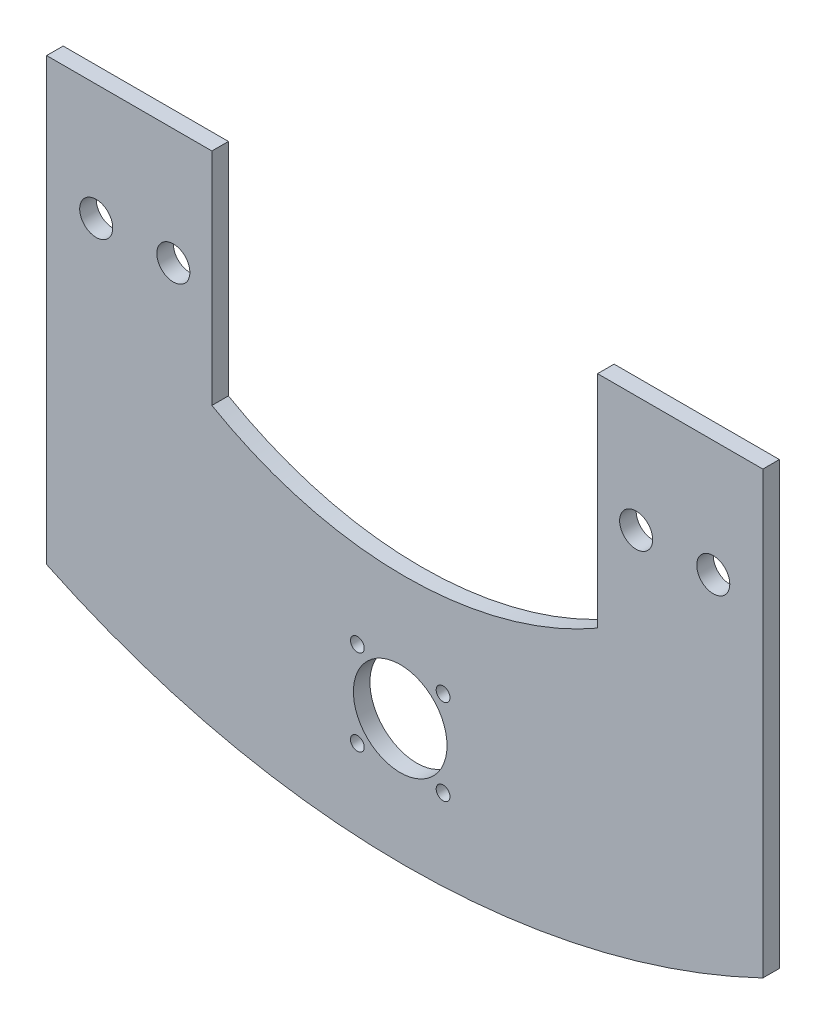
ISO-10303-21;
HEADER;
FILE_DESCRIPTION(('STEP AP214'),'2;1');
FILE_NAME('part.step','',(''),(''),'','','');
FILE_SCHEMA(('AUTOMOTIVE_DESIGN { 1 0 10303 214 1 1 1 1 }'));
ENDSEC;
DATA;
#1=APPLICATION_CONTEXT('core data for automotive mechanical design processes');
#2=APPLICATION_PROTOCOL_DEFINITION('international standard','automotive_design',2000,#1);
#3=PRODUCT_CONTEXT('',#1,'mechanical');
#4=PRODUCT('Part','Part','',(#3));
#5=PRODUCT_RELATED_PRODUCT_CATEGORY('part','',(#4));
#6=PRODUCT_DEFINITION_FORMATION('','',#4);
#7=PRODUCT_DEFINITION_CONTEXT('part definition',#1,'design');
#8=PRODUCT_DEFINITION('design','',#6,#7);
#9=PRODUCT_DEFINITION_SHAPE('','',#8);
#10=(LENGTH_UNIT() NAMED_UNIT(*) SI_UNIT(.MILLI.,.METRE.));
#11=(NAMED_UNIT(*) PLANE_ANGLE_UNIT() SI_UNIT($,.RADIAN.));
#12=(NAMED_UNIT(*) SI_UNIT($,.STERADIAN.) SOLID_ANGLE_UNIT());
#13=UNCERTAINTY_MEASURE_WITH_UNIT(LENGTH_MEASURE(1.E-05),#10,'distance_accuracy_value','');
#14=(GEOMETRIC_REPRESENTATION_CONTEXT(3) GLOBAL_UNCERTAINTY_ASSIGNED_CONTEXT((#13)) GLOBAL_UNIT_ASSIGNED_CONTEXT((#10,
#11,#12)) REPRESENTATION_CONTEXT('',''));
#15=CARTESIAN_POINT('',(0.,0.,0.));
#16=DIRECTION('',(0.,0.,1.));
#17=DIRECTION('',(1.,0.,0.));
#18=AXIS2_PLACEMENT_3D('',#15,#16,#17);
#19=CARTESIAN_POINT('',(0.820334830002166,96.841601103084,3.));
#20=DIRECTION('',(0.,0.,1.));
#21=DIRECTION('',(1.,0.,0.));
#22=AXIS2_PLACEMENT_3D('',#19,#20,#21);
#23=PLANE('',#22);
#24=CARTESIAN_POINT('',(7.78,-38.2569345928676,3.));
#25=DIRECTION('',(0.,0.,1.));
#26=DIRECTION('',(-1.,0.,0.));
#27=AXIS2_PLACEMENT_3D('',#24,#25,#26);
#28=CIRCLE('',#27,1.25);
#29=CARTESIAN_POINT('',(6.53,-38.2569345928676,3.));
#30=VERTEX_POINT('',#29);
#31=EDGE_CURVE('E293',#30,#30,#28,.T.);
#32=ORIENTED_EDGE('',*,*,#31,.F.);
#33=EDGE_LOOP('',(#32));
#34=FACE_BOUND('',#33,.T.);
#35=CARTESIAN_POINT('',(0.,-30.4769345928675,3.));
#36=DIRECTION('',(0.,0.,1.));
#37=DIRECTION('',(1.,0.,0.));
#38=AXIS2_PLACEMENT_3D('',#35,#36,#37);
#39=CIRCLE('',#38,8.5);
#40=CARTESIAN_POINT('',(8.5,-30.4769345928675,3.));
#41=VERTEX_POINT('',#40);
#42=EDGE_CURVE('E297',#41,#41,#39,.T.);
#43=ORIENTED_EDGE('',*,*,#42,.F.);
#44=EDGE_LOOP('',(#43));
#45=FACE_BOUND('',#44,.T.);
#46=CARTESIAN_POINT('',(-7.78,-38.2569345928676,3.));
#47=DIRECTION('',(0.,0.,1.));
#48=DIRECTION('',(1.,0.,0.));
#49=AXIS2_PLACEMENT_3D('',#46,#47,#48);
#50=CIRCLE('',#49,1.24999999999999);
#51=CARTESIAN_POINT('',(-6.53000000000001,-38.2569345928676,3.));
#52=VERTEX_POINT('',#51);
#53=EDGE_CURVE('E283',#52,#52,#50,.T.);
#54=ORIENTED_EDGE('',*,*,#53,.F.);
#55=EDGE_LOOP('',(#54));
#56=FACE_BOUND('',#55,.T.);
#57=CARTESIAN_POINT('',(-7.78,-22.6969345928675,3.));
#58=DIRECTION('',(0.,0.,1.));
#59=DIRECTION('',(-1.,0.,0.));
#60=AXIS2_PLACEMENT_3D('',#57,#58,#59);
#61=CIRCLE('',#60,1.24999999999999);
#62=CARTESIAN_POINT('',(-9.03,-22.6969345928675,3.));
#63=VERTEX_POINT('',#62);
#64=EDGE_CURVE('E294',#63,#63,#61,.T.);
#65=ORIENTED_EDGE('',*,*,#64,.F.);
#66=EDGE_LOOP('',(#65));
#67=FACE_BOUND('',#66,.T.);
#68=CARTESIAN_POINT('',(7.78,-22.6969345928675,3.));
#69=DIRECTION('',(0.,0.,1.));
#70=DIRECTION('',(1.,0.,0.));
#71=AXIS2_PLACEMENT_3D('',#68,#69,#70);
#72=CIRCLE('',#71,1.25);
#73=CARTESIAN_POINT('',(9.03,-22.6969345928675,3.));
#74=VERTEX_POINT('',#73);
#75=EDGE_CURVE('E164',#74,#74,#72,.T.);
#76=ORIENTED_EDGE('',*,*,#75,.F.);
#77=EDGE_LOOP('',(#76));
#78=FACE_BOUND('',#77,.T.);
#79=CARTESIAN_POINT('',(-55.1796651699977,20.5544747081712,3.));
#80=DIRECTION('',(0.,0.,1.));
#81=DIRECTION('',(-1.,0.,0.));
#82=AXIS2_PLACEMENT_3D('',#79,#80,#81);
#83=CIRCLE('',#82,3.);
#84=CARTESIAN_POINT('',(-58.1796651699977,20.5544747081712,3.));
#85=VERTEX_POINT('',#84);
#86=EDGE_CURVE('E187',#85,#85,#83,.T.);
#87=ORIENTED_EDGE('',*,*,#86,.F.);
#88=EDGE_LOOP('',(#87));
#89=FACE_BOUND('',#88,.T.);
#90=CARTESIAN_POINT('',(56.8203348300023,20.5544747081712,3.));
#91=DIRECTION('',(0.,0.,1.));
#92=DIRECTION('',(1.,0.,0.));
#93=AXIS2_PLACEMENT_3D('',#90,#91,#92);
#94=CIRCLE('',#93,3.);
#95=CARTESIAN_POINT('',(59.8203348300023,20.5544747081712,3.));
#96=VERTEX_POINT('',#95);
#97=EDGE_CURVE('E137',#96,#96,#94,.T.);
#98=ORIENTED_EDGE('',*,*,#97,.F.);
#99=EDGE_LOOP('',(#98));
#100=FACE_BOUND('',#99,.T.);
#101=DIRECTION('',(-1.,0.,0.));
#102=VECTOR('',#101,1.);
#103=CARTESIAN_POINT('',(-34.1796651699977,41.6565427571262,3.));
#104=LINE('',#103,#102);
#105=CARTESIAN_POINT('',(-34.1796651699977,41.6565427571262,3.));
#106=VERTEX_POINT('',#105);
#107=CARTESIAN_POINT('',(-64.1796651699977,41.6565427571262,3.));
#108=VERTEX_POINT('',#107);
#109=EDGE_CURVE('E148',#106,#108,#104,.T.);
#110=ORIENTED_EDGE('',*,*,#109,.T.);
#111=DIRECTION('',(0.,-1.,0.));
#112=VECTOR('',#111,1.);
#113=CARTESIAN_POINT('',(-64.1796651699977,41.6565427571262,3.));
#114=LINE('',#113,#112);
#115=CARTESIAN_POINT('',(-64.1796651699977,-38.3434572428738,3.));
#116=VERTEX_POINT('',#115);
#117=EDGE_CURVE('E96',#108,#116,#114,.T.);
#118=ORIENTED_EDGE('',*,*,#117,.T.);
#119=CARTESIAN_POINT('',(0.820334830002166,96.841601103084,3.));
#120=DIRECTION('',(0.,0.,1.));
#121=DIRECTION('',(1.,0.,0.));
#122=AXIS2_PLACEMENT_3D('',#119,#120,#121);
#123=CIRCLE('',#122,150.);
#124=CARTESIAN_POINT('',(65.8203348300023,-38.3434572428737,3.));
#125=VERTEX_POINT('',#124);
#126=EDGE_CURVE('E205',#116,#125,#123,.T.);
#127=ORIENTED_EDGE('',*,*,#126,.T.);
#128=DIRECTION('',(0.,1.,0.));
#129=VECTOR('',#128,1.);
#130=CARTESIAN_POINT('',(65.8203348300023,-38.3434572428737,3.));
#131=LINE('',#130,#129);
#132=CARTESIAN_POINT('',(65.8203348300023,41.6565427571263,3.));
#133=VERTEX_POINT('',#132);
#134=EDGE_CURVE('E207',#125,#133,#131,.T.);
#135=ORIENTED_EDGE('',*,*,#134,.T.);
#136=DIRECTION('',(-1.,0.,0.));
#137=VECTOR('',#136,1.);
#138=CARTESIAN_POINT('',(65.8203348300023,41.6565427571263,3.));
#139=LINE('',#138,#137);
#140=CARTESIAN_POINT('',(35.8203348300023,41.6565427571263,3.));
#141=VERTEX_POINT('',#140);
#142=EDGE_CURVE('E115',#133,#141,#139,.T.);
#143=ORIENTED_EDGE('',*,*,#142,.T.);
#144=DIRECTION('',(0.,-1.,0.));
#145=VECTOR('',#144,1.);
#146=CARTESIAN_POINT('',(35.8203348300023,41.6565427571263,3.));
#147=LINE('',#146,#145);
#148=CARTESIAN_POINT('',(35.8203348300023,1.6565427571263,3.));
#149=VERTEX_POINT('',#148);
#150=EDGE_CURVE('E109',#141,#149,#147,.T.);
#151=ORIENTED_EDGE('',*,*,#150,.T.);
#152=CARTESIAN_POINT('',(0.820334830002178,62.2783210220369,3.));
#153=DIRECTION('',(0.,0.,-1.));
#154=DIRECTION('',(1.,0.,0.));
#155=AXIS2_PLACEMENT_3D('',#152,#153,#154);
#156=CIRCLE('',#155,70.);
#157=CARTESIAN_POINT('',(-34.1796651699977,1.65654275712619,3.));
#158=VERTEX_POINT('',#157);
#159=EDGE_CURVE('E113',#149,#158,#156,.T.);
#160=ORIENTED_EDGE('',*,*,#159,.T.);
#161=DIRECTION('',(0.,1.,0.));
#162=VECTOR('',#161,1.);
#163=CARTESIAN_POINT('',(-34.1796651699977,1.65654275712619,3.));
#164=LINE('',#163,#162);
#165=EDGE_CURVE('E53',#158,#106,#164,.T.);
#166=ORIENTED_EDGE('',*,*,#165,.T.);
#167=EDGE_LOOP('',(#110,#118,#127,#135,#143,#151,#160,#166));
#168=FACE_BOUND('',#167,.T.);
#169=CARTESIAN_POINT('',(42.8203348300023,20.5544747081712,3.));
#170=DIRECTION('',(0.,0.,1.));
#171=DIRECTION('',(1.,0.,0.));
#172=AXIS2_PLACEMENT_3D('',#169,#170,#171);
#173=CIRCLE('',#172,2.99999999999999);
#174=CARTESIAN_POINT('',(45.8203348300023,20.5544747081712,3.));
#175=VERTEX_POINT('',#174);
#176=EDGE_CURVE('E193',#175,#175,#173,.T.);
#177=ORIENTED_EDGE('',*,*,#176,.F.);
#178=EDGE_LOOP('',(#177));
#179=FACE_BOUND('',#178,.T.);
#180=CARTESIAN_POINT('',(-41.1796651699977,20.5544747081712,3.));
#181=DIRECTION('',(0.,0.,1.));
#182=DIRECTION('',(-1.,0.,0.));
#183=AXIS2_PLACEMENT_3D('',#180,#181,#182);
#184=CIRCLE('',#183,2.99999999999999);
#185=CARTESIAN_POINT('',(-44.1796651699977,20.5544747081712,3.));
#186=VERTEX_POINT('',#185);
#187=EDGE_CURVE('E178',#186,#186,#184,.T.);
#188=ORIENTED_EDGE('',*,*,#187,.F.);
#189=EDGE_LOOP('',(#188));
#190=FACE_BOUND('',#189,.T.);
#191=ADVANCED_FACE('F34',(#34,#45,#56,#67,#78,#89,#100,#168,#179,#190),#23,.T.);
#192=CARTESIAN_POINT('',(0.820334830002166,96.841601103084,0.));
#193=DIRECTION('',(0.,0.,1.));
#194=DIRECTION('',(1.,0.,0.));
#195=AXIS2_PLACEMENT_3D('',#192,#193,#194);
#196=PLANE('',#195);
#197=CARTESIAN_POINT('',(7.78,-38.2569345928676,0.));
#198=DIRECTION('',(0.,0.,1.));
#199=DIRECTION('',(1.,0.,0.));
#200=AXIS2_PLACEMENT_3D('',#197,#198,#199);
#201=CIRCLE('',#200,1.25);
#202=CARTESIAN_POINT('',(9.03,-38.2569345928676,0.));
#203=VERTEX_POINT('',#202);
#204=EDGE_CURVE('E38',#203,#203,#201,.T.);
#205=ORIENTED_EDGE('',*,*,#204,.T.);
#206=EDGE_LOOP('',(#205));
#207=FACE_BOUND('',#206,.T.);
#208=CARTESIAN_POINT('',(0.,-30.4769345928675,0.));
#209=DIRECTION('',(0.,0.,1.));
#210=DIRECTION('',(1.,0.,0.));
#211=AXIS2_PLACEMENT_3D('',#208,#209,#210);
#212=CIRCLE('',#211,8.5);
#213=CARTESIAN_POINT('',(8.5,-30.4769345928675,0.));
#214=VERTEX_POINT('',#213);
#215=EDGE_CURVE('E169',#214,#214,#212,.T.);
#216=ORIENTED_EDGE('',*,*,#215,.T.);
#217=EDGE_LOOP('',(#216));
#218=FACE_BOUND('',#217,.T.);
#219=CARTESIAN_POINT('',(-7.78,-38.2569345928676,0.));
#220=DIRECTION('',(0.,0.,1.));
#221=DIRECTION('',(1.,0.,0.));
#222=AXIS2_PLACEMENT_3D('',#219,#220,#221);
#223=CIRCLE('',#222,1.24999999999999);
#224=CARTESIAN_POINT('',(-6.53000000000001,-38.2569345928676,0.));
#225=VERTEX_POINT('',#224);
#226=EDGE_CURVE('E167',#225,#225,#223,.T.);
#227=ORIENTED_EDGE('',*,*,#226,.T.);
#228=EDGE_LOOP('',(#227));
#229=FACE_BOUND('',#228,.T.);
#230=CARTESIAN_POINT('',(-7.78,-22.6969345928675,0.));
#231=DIRECTION('',(0.,0.,1.));
#232=DIRECTION('',(1.,0.,0.));
#233=AXIS2_PLACEMENT_3D('',#230,#231,#232);
#234=CIRCLE('',#233,1.24999999999999);
#235=CARTESIAN_POINT('',(-6.53000000000001,-22.6969345928675,0.));
#236=VERTEX_POINT('',#235);
#237=EDGE_CURVE('E163',#236,#236,#234,.T.);
#238=ORIENTED_EDGE('',*,*,#237,.T.);
#239=EDGE_LOOP('',(#238));
#240=FACE_BOUND('',#239,.T.);
#241=CARTESIAN_POINT('',(7.78,-22.6969345928675,0.));
#242=DIRECTION('',(0.,0.,1.));
#243=DIRECTION('',(1.,0.,0.));
#244=AXIS2_PLACEMENT_3D('',#241,#242,#243);
#245=CIRCLE('',#244,1.25);
#246=CARTESIAN_POINT('',(9.03,-22.6969345928675,0.));
#247=VERTEX_POINT('',#246);
#248=EDGE_CURVE('E160',#247,#247,#245,.T.);
#249=ORIENTED_EDGE('',*,*,#248,.T.);
#250=EDGE_LOOP('',(#249));
#251=FACE_BOUND('',#250,.T.);
#252=DIRECTION('',(-1.,0.,0.));
#253=VECTOR('',#252,1.);
#254=CARTESIAN_POINT('',(-34.1796651699977,41.6565427571262,0.));
#255=LINE('',#254,#253);
#256=CARTESIAN_POINT('',(-34.1796651699977,41.6565427571262,0.));
#257=VERTEX_POINT('',#256);
#258=CARTESIAN_POINT('',(-64.1796651699977,41.6565427571262,0.));
#259=VERTEX_POINT('',#258);
#260=EDGE_CURVE('E133',#257,#259,#255,.T.);
#261=ORIENTED_EDGE('',*,*,#260,.F.);
#262=DIRECTION('',(0.,1.,0.));
#263=VECTOR('',#262,1.);
#264=CARTESIAN_POINT('',(-34.1796651699977,1.65654275712619,0.));
#265=LINE('',#264,#263);
#266=CARTESIAN_POINT('',(-34.1796651699977,1.65654275712619,0.));
#267=VERTEX_POINT('',#266);
#268=EDGE_CURVE('E88',#267,#257,#265,.T.);
#269=ORIENTED_EDGE('',*,*,#268,.F.);
#270=CARTESIAN_POINT('',(0.820334830002178,62.2783210220369,0.));
#271=DIRECTION('',(0.,0.,-1.));
#272=DIRECTION('',(1.,0.,0.));
#273=AXIS2_PLACEMENT_3D('',#270,#271,#272);
#274=CIRCLE('',#273,70.);
#275=CARTESIAN_POINT('',(35.8203348300023,1.6565427571263,0.));
#276=VERTEX_POINT('',#275);
#277=EDGE_CURVE('E82',#276,#267,#274,.T.);
#278=ORIENTED_EDGE('',*,*,#277,.F.);
#279=DIRECTION('',(0.,-1.,0.));
#280=VECTOR('',#279,1.);
#281=CARTESIAN_POINT('',(35.8203348300023,41.6565427571263,0.));
#282=LINE('',#281,#280);
#283=CARTESIAN_POINT('',(35.8203348300023,41.6565427571263,0.));
#284=VERTEX_POINT('',#283);
#285=EDGE_CURVE('E123',#284,#276,#282,.T.);
#286=ORIENTED_EDGE('',*,*,#285,.F.);
#287=DIRECTION('',(-1.,0.,0.));
#288=VECTOR('',#287,1.);
#289=CARTESIAN_POINT('',(65.8203348300023,41.6565427571263,0.));
#290=LINE('',#289,#288);
#291=CARTESIAN_POINT('',(65.8203348300023,41.6565427571263,0.));
#292=VERTEX_POINT('',#291);
#293=EDGE_CURVE('E143',#292,#284,#290,.T.);
#294=ORIENTED_EDGE('',*,*,#293,.F.);
#295=DIRECTION('',(0.,1.,0.));
#296=VECTOR('',#295,1.);
#297=CARTESIAN_POINT('',(65.8203348300023,-38.3434572428737,0.));
#298=LINE('',#297,#296);
#299=CARTESIAN_POINT('',(65.8203348300023,-38.3434572428737,0.));
#300=VERTEX_POINT('',#299);
#301=EDGE_CURVE('E141',#300,#292,#298,.T.);
#302=ORIENTED_EDGE('',*,*,#301,.F.);
#303=CARTESIAN_POINT('',(0.820334830002166,96.841601103084,0.));
#304=DIRECTION('',(0.,0.,1.));
#305=DIRECTION('',(1.,0.,0.));
#306=AXIS2_PLACEMENT_3D('',#303,#304,#305);
#307=CIRCLE('',#306,150.);
#308=CARTESIAN_POINT('',(-64.1796651699977,-38.3434572428738,0.));
#309=VERTEX_POINT('',#308);
#310=EDGE_CURVE('E139',#309,#300,#307,.T.);
#311=ORIENTED_EDGE('',*,*,#310,.F.);
#312=DIRECTION('',(0.,-1.,0.));
#313=VECTOR('',#312,1.);
#314=CARTESIAN_POINT('',(-64.1796651699977,41.6565427571262,0.));
#315=LINE('',#314,#313);
#316=EDGE_CURVE('E136',#259,#309,#315,.T.);
#317=ORIENTED_EDGE('',*,*,#316,.F.);
#318=EDGE_LOOP('',(#261,#269,#278,#286,#294,#302,#311,#317));
#319=FACE_BOUND('',#318,.T.);
#320=CARTESIAN_POINT('',(56.8203348300023,20.5544747081712,0.));
#321=DIRECTION('',(0.,0.,1.));
#322=DIRECTION('',(1.,0.,0.));
#323=AXIS2_PLACEMENT_3D('',#320,#321,#322);
#324=CIRCLE('',#323,3.);
#325=CARTESIAN_POINT('',(59.8203348300023,20.5544747081712,0.));
#326=VERTEX_POINT('',#325);
#327=EDGE_CURVE('E196',#326,#326,#324,.T.);
#328=ORIENTED_EDGE('',*,*,#327,.T.);
#329=EDGE_LOOP('',(#328));
#330=FACE_BOUND('',#329,.T.);
#331=CARTESIAN_POINT('',(42.8203348300023,20.5544747081712,0.));
#332=DIRECTION('',(0.,0.,1.));
#333=DIRECTION('',(1.,0.,0.));
#334=AXIS2_PLACEMENT_3D('',#331,#332,#333);
#335=CIRCLE('',#334,2.99999999999999);
#336=CARTESIAN_POINT('',(45.8203348300023,20.5544747081712,0.));
#337=VERTEX_POINT('',#336);
#338=EDGE_CURVE('E190',#337,#337,#335,.T.);
#339=ORIENTED_EDGE('',*,*,#338,.T.);
#340=EDGE_LOOP('',(#339));
#341=FACE_BOUND('',#340,.T.);
#342=CARTESIAN_POINT('',(-55.1796651699977,20.5544747081712,0.));
#343=DIRECTION('',(0.,0.,1.));
#344=DIRECTION('',(-1.,0.,0.));
#345=AXIS2_PLACEMENT_3D('',#342,#343,#344);
#346=CIRCLE('',#345,3.);
#347=CARTESIAN_POINT('',(-58.1796651699977,20.5544747081712,0.));
#348=VERTEX_POINT('',#347);
#349=EDGE_CURVE('E183',#348,#348,#346,.T.);
#350=ORIENTED_EDGE('',*,*,#349,.T.);
#351=EDGE_LOOP('',(#350));
#352=FACE_BOUND('',#351,.T.);
#353=CARTESIAN_POINT('',(-41.1796651699977,20.5544747081712,0.));
#354=DIRECTION('',(0.,0.,1.));
#355=DIRECTION('',(-1.,0.,0.));
#356=AXIS2_PLACEMENT_3D('',#353,#354,#355);
#357=CIRCLE('',#356,2.99999999999999);
#358=CARTESIAN_POINT('',(-44.1796651699977,20.5544747081712,0.));
#359=VERTEX_POINT('',#358);
#360=EDGE_CURVE('E174',#359,#359,#357,.T.);
#361=ORIENTED_EDGE('',*,*,#360,.T.);
#362=EDGE_LOOP('',(#361));
#363=FACE_BOUND('',#362,.T.);
#364=ADVANCED_FACE('F220',(#207,#218,#229,#240,#251,#319,#330,#341,#352,#363),#196,.F.);
#365=CARTESIAN_POINT('',(-34.1796651699977,41.6565427571262,3.));
#366=DIRECTION('',(0.,-1.,0.));
#367=DIRECTION('',(0.,0.,-1.));
#368=AXIS2_PLACEMENT_3D('',#365,#366,#367);
#369=PLANE('',#368);
#370=ORIENTED_EDGE('',*,*,#260,.T.);
#371=DIRECTION('',(0.,0.,-1.));
#372=VECTOR('',#371,1.);
#373=CARTESIAN_POINT('',(-64.1796651699977,41.6565427571262,3.));
#374=LINE('',#373,#372);
#375=EDGE_CURVE('E11',#108,#259,#374,.T.);
#376=ORIENTED_EDGE('',*,*,#375,.F.);
#377=ORIENTED_EDGE('',*,*,#109,.F.);
#378=DIRECTION('',(0.,0.,-1.));
#379=VECTOR('',#378,1.);
#380=CARTESIAN_POINT('',(-34.1796651699977,41.6565427571262,3.));
#381=LINE('',#380,#379);
#382=EDGE_CURVE('E129',#106,#257,#381,.T.);
#383=ORIENTED_EDGE('',*,*,#382,.T.);
#384=EDGE_LOOP('',(#370,#376,#377,#383));
#385=FACE_BOUND('',#384,.T.);
#386=ADVANCED_FACE('F36',(#385),#369,.F.);
#387=CARTESIAN_POINT('',(-64.1796651699977,41.6565427571262,3.));
#388=DIRECTION('',(1.,0.,0.));
#389=DIRECTION('',(0.,0.,-1.));
#390=AXIS2_PLACEMENT_3D('',#387,#388,#389);
#391=PLANE('',#390);
#392=ORIENTED_EDGE('',*,*,#316,.T.);
#393=DIRECTION('',(0.,0.,-1.));
#394=VECTOR('',#393,1.);
#395=CARTESIAN_POINT('',(-64.1796651699977,-38.3434572428738,3.));
#396=LINE('',#395,#394);
#397=EDGE_CURVE('E44',#116,#309,#396,.T.);
#398=ORIENTED_EDGE('',*,*,#397,.F.);
#399=ORIENTED_EDGE('',*,*,#117,.F.);
#400=ORIENTED_EDGE('',*,*,#375,.T.);
#401=EDGE_LOOP('',(#392,#398,#399,#400));
#402=FACE_BOUND('',#401,.T.);
#403=ADVANCED_FACE('F408',(#402),#391,.F.);
#404=CARTESIAN_POINT('',(0.820334830002166,96.841601103084,3.));
#405=DIRECTION('',(0.,0.,-1.));
#406=DIRECTION('',(-1.,0.,0.));
#407=AXIS2_PLACEMENT_3D('',#404,#405,#406);
#408=CYLINDRICAL_SURFACE('',#407,150.);
#409=ORIENTED_EDGE('',*,*,#310,.T.);
#410=DIRECTION('',(0.,0.,-1.));
#411=VECTOR('',#410,1.);
#412=CARTESIAN_POINT('',(65.8203348300023,-38.3434572428737,3.));
#413=LINE('',#412,#411);
#414=EDGE_CURVE('E155',#125,#300,#413,.T.);
#415=ORIENTED_EDGE('',*,*,#414,.F.);
#416=ORIENTED_EDGE('',*,*,#126,.F.);
#417=ORIENTED_EDGE('',*,*,#397,.T.);
#418=EDGE_LOOP('',(#409,#415,#416,#417));
#419=FACE_BOUND('',#418,.T.);
#420=ADVANCED_FACE('F400',(#419),#408,.T.);
#421=CARTESIAN_POINT('',(65.8203348300023,-38.3434572428737,3.));
#422=DIRECTION('',(-1.,0.,0.));
#423=DIRECTION('',(0.,0.,1.));
#424=AXIS2_PLACEMENT_3D('',#421,#422,#423);
#425=PLANE('',#424);
#426=ORIENTED_EDGE('',*,*,#301,.T.);
#427=DIRECTION('',(0.,0.,-1.));
#428=VECTOR('',#427,1.);
#429=CARTESIAN_POINT('',(65.8203348300023,41.6565427571263,3.));
#430=LINE('',#429,#428);
#431=EDGE_CURVE('E152',#133,#292,#430,.T.);
#432=ORIENTED_EDGE('',*,*,#431,.F.);
#433=ORIENTED_EDGE('',*,*,#134,.F.);
#434=ORIENTED_EDGE('',*,*,#414,.T.);
#435=EDGE_LOOP('',(#426,#432,#433,#434));
#436=FACE_BOUND('',#435,.T.);
#437=ADVANCED_FACE('F213',(#436),#425,.F.);
#438=CARTESIAN_POINT('',(65.8203348300023,41.6565427571263,3.));
#439=DIRECTION('',(0.,-1.,0.));
#440=DIRECTION('',(0.,0.,-1.));
#441=AXIS2_PLACEMENT_3D('',#438,#439,#440);
#442=PLANE('',#441);
#443=ORIENTED_EDGE('',*,*,#293,.T.);
#444=DIRECTION('',(0.,0.,-1.));
#445=VECTOR('',#444,1.);
#446=CARTESIAN_POINT('',(35.8203348300023,41.6565427571263,3.));
#447=LINE('',#446,#445);
#448=EDGE_CURVE('E124',#141,#284,#447,.T.);
#449=ORIENTED_EDGE('',*,*,#448,.F.);
#450=ORIENTED_EDGE('',*,*,#142,.F.);
#451=ORIENTED_EDGE('',*,*,#431,.T.);
#452=EDGE_LOOP('',(#443,#449,#450,#451));
#453=FACE_BOUND('',#452,.T.);
#454=ADVANCED_FACE('F217',(#453),#442,.F.);
#455=CARTESIAN_POINT('',(35.8203348300023,41.6565427571263,3.));
#456=DIRECTION('',(1.,0.,0.));
#457=DIRECTION('',(0.,1.,0.));
#458=AXIS2_PLACEMENT_3D('',#455,#456,#457);
#459=PLANE('',#458);
#460=ORIENTED_EDGE('',*,*,#285,.T.);
#461=DIRECTION('',(0.,0.,-1.));
#462=VECTOR('',#461,1.);
#463=CARTESIAN_POINT('',(35.8203348300023,1.6565427571263,3.));
#464=LINE('',#463,#462);
#465=EDGE_CURVE('E120',#149,#276,#464,.T.);
#466=ORIENTED_EDGE('',*,*,#465,.F.);
#467=ORIENTED_EDGE('',*,*,#150,.F.);
#468=ORIENTED_EDGE('',*,*,#448,.T.);
#469=EDGE_LOOP('',(#460,#466,#467,#468));
#470=FACE_BOUND('',#469,.T.);
#471=ADVANCED_FACE('F121',(#470),#459,.F.);
#472=CARTESIAN_POINT('',(0.820334830002178,62.2783210220369,3.));
#473=DIRECTION('',(0.,0.,-1.));
#474=DIRECTION('',(-1.,0.,0.));
#475=AXIS2_PLACEMENT_3D('',#472,#473,#474);
#476=CYLINDRICAL_SURFACE('',#475,70.);
#477=ORIENTED_EDGE('',*,*,#277,.T.);
#478=DIRECTION('',(0.,0.,-1.));
#479=VECTOR('',#478,1.);
#480=CARTESIAN_POINT('',(-34.1796651699977,1.65654275712619,3.));
#481=LINE('',#480,#479);
#482=EDGE_CURVE('E125',#158,#267,#481,.T.);
#483=ORIENTED_EDGE('',*,*,#482,.F.);
#484=ORIENTED_EDGE('',*,*,#159,.F.);
#485=ORIENTED_EDGE('',*,*,#465,.T.);
#486=EDGE_LOOP('',(#477,#483,#484,#485));
#487=FACE_BOUND('',#486,.T.);
#488=ADVANCED_FACE('F127',(#487),#476,.F.);
#489=CARTESIAN_POINT('',(-34.1796651699977,1.65654275712619,3.));
#490=DIRECTION('',(-1.,0.,0.));
#491=DIRECTION('',(0.,-1.,0.));
#492=AXIS2_PLACEMENT_3D('',#489,#490,#491);
#493=PLANE('',#492);
#494=ORIENTED_EDGE('',*,*,#268,.T.);
#495=ORIENTED_EDGE('',*,*,#382,.F.);
#496=ORIENTED_EDGE('',*,*,#165,.F.);
#497=ORIENTED_EDGE('',*,*,#482,.T.);
#498=EDGE_LOOP('',(#494,#495,#496,#497));
#499=FACE_BOUND('',#498,.T.);
#500=ADVANCED_FACE('F226',(#499),#493,.F.);
#501=CARTESIAN_POINT('',(56.8203348300023,20.5544747081712,3.));
#502=DIRECTION('',(0.,0.,-1.));
#503=DIRECTION('',(-1.,0.,0.));
#504=AXIS2_PLACEMENT_3D('',#501,#502,#503);
#505=CYLINDRICAL_SURFACE('',#504,3.);
#506=ORIENTED_EDGE('',*,*,#97,.T.);
#507=EDGE_LOOP('',(#506));
#508=FACE_BOUND('',#507,.T.);
#509=ORIENTED_EDGE('',*,*,#327,.F.);
#510=EDGE_LOOP('',(#509));
#511=FACE_BOUND('',#510,.T.);
#512=ADVANCED_FACE('F228',(#508,#511),#505,.F.);
#513=CARTESIAN_POINT('',(42.8203348300023,20.5544747081712,3.));
#514=DIRECTION('',(0.,0.,-1.));
#515=DIRECTION('',(-1.,0.,0.));
#516=AXIS2_PLACEMENT_3D('',#513,#514,#515);
#517=CYLINDRICAL_SURFACE('',#516,2.99999999999999);
#518=ORIENTED_EDGE('',*,*,#176,.T.);
#519=EDGE_LOOP('',(#518));
#520=FACE_BOUND('',#519,.T.);
#521=ORIENTED_EDGE('',*,*,#338,.F.);
#522=EDGE_LOOP('',(#521));
#523=FACE_BOUND('',#522,.T.);
#524=ADVANCED_FACE('F234',(#520,#523),#517,.F.);
#525=CARTESIAN_POINT('',(-55.1796651699977,20.5544747081712,3.));
#526=DIRECTION('',(0.,0.,-1.));
#527=DIRECTION('',(-1.,0.,0.));
#528=AXIS2_PLACEMENT_3D('',#525,#526,#527);
#529=CYLINDRICAL_SURFACE('',#528,3.);
#530=ORIENTED_EDGE('',*,*,#86,.T.);
#531=EDGE_LOOP('',(#530));
#532=FACE_BOUND('',#531,.T.);
#533=ORIENTED_EDGE('',*,*,#349,.F.);
#534=EDGE_LOOP('',(#533));
#535=FACE_BOUND('',#534,.T.);
#536=ADVANCED_FACE('F250',(#532,#535),#529,.F.);
#537=CARTESIAN_POINT('',(-41.1796651699977,20.5544747081712,3.));
#538=DIRECTION('',(0.,0.,-1.));
#539=DIRECTION('',(-1.,0.,0.));
#540=AXIS2_PLACEMENT_3D('',#537,#538,#539);
#541=CYLINDRICAL_SURFACE('',#540,2.99999999999999);
#542=ORIENTED_EDGE('',*,*,#187,.T.);
#543=EDGE_LOOP('',(#542));
#544=FACE_BOUND('',#543,.T.);
#545=ORIENTED_EDGE('',*,*,#360,.F.);
#546=EDGE_LOOP('',(#545));
#547=FACE_BOUND('',#546,.T.);
#548=ADVANCED_FACE('F254',(#544,#547),#541,.F.);
#549=CARTESIAN_POINT('',(7.78,-22.6969345928675,-7.));
#550=DIRECTION('',(0.,0.,1.));
#551=DIRECTION('',(1.,0.,0.));
#552=AXIS2_PLACEMENT_3D('',#549,#550,#551);
#553=CYLINDRICAL_SURFACE('',#552,1.25);
#554=ORIENTED_EDGE('',*,*,#75,.T.);
#555=EDGE_LOOP('',(#554));
#556=FACE_BOUND('',#555,.T.);
#557=ORIENTED_EDGE('',*,*,#248,.F.);
#558=EDGE_LOOP('',(#557));
#559=FACE_BOUND('',#558,.T.);
#560=ADVANCED_FACE('F258',(#556,#559),#553,.F.);
#561=CARTESIAN_POINT('',(-7.78,-22.6969345928675,-7.));
#562=DIRECTION('',(0.,0.,1.));
#563=DIRECTION('',(1.,0.,0.));
#564=AXIS2_PLACEMENT_3D('',#561,#562,#563);
#565=CYLINDRICAL_SURFACE('',#564,1.24999999999999);
#566=ORIENTED_EDGE('',*,*,#64,.T.);
#567=EDGE_LOOP('',(#566));
#568=FACE_BOUND('',#567,.T.);
#569=ORIENTED_EDGE('',*,*,#237,.F.);
#570=EDGE_LOOP('',(#569));
#571=FACE_BOUND('',#570,.T.);
#572=ADVANCED_FACE('F262',(#568,#571),#565,.F.);
#573=CARTESIAN_POINT('',(-7.78,-38.2569345928676,-7.));
#574=DIRECTION('',(0.,0.,1.));
#575=DIRECTION('',(1.,0.,0.));
#576=AXIS2_PLACEMENT_3D('',#573,#574,#575);
#577=CYLINDRICAL_SURFACE('',#576,1.24999999999999);
#578=ORIENTED_EDGE('',*,*,#53,.T.);
#579=EDGE_LOOP('',(#578));
#580=FACE_BOUND('',#579,.T.);
#581=ORIENTED_EDGE('',*,*,#226,.F.);
#582=EDGE_LOOP('',(#581));
#583=FACE_BOUND('',#582,.T.);
#584=ADVANCED_FACE('F268',(#580,#583),#577,.F.);
#585=CARTESIAN_POINT('',(0.,-30.4769345928675,-7.));
#586=DIRECTION('',(0.,0.,1.));
#587=DIRECTION('',(1.,0.,0.));
#588=AXIS2_PLACEMENT_3D('',#585,#586,#587);
#589=CYLINDRICAL_SURFACE('',#588,8.5);
#590=ORIENTED_EDGE('',*,*,#42,.T.);
#591=EDGE_LOOP('',(#590));
#592=FACE_BOUND('',#591,.T.);
#593=ORIENTED_EDGE('',*,*,#215,.F.);
#594=EDGE_LOOP('',(#593));
#595=FACE_BOUND('',#594,.T.);
#596=ADVANCED_FACE('F264',(#592,#595),#589,.F.);
#597=CARTESIAN_POINT('',(7.78,-38.2569345928676,-7.));
#598=DIRECTION('',(0.,0.,1.));
#599=DIRECTION('',(1.,0.,0.));
#600=AXIS2_PLACEMENT_3D('',#597,#598,#599);
#601=CYLINDRICAL_SURFACE('',#600,1.25);
#602=ORIENTED_EDGE('',*,*,#31,.T.);
#603=EDGE_LOOP('',(#602));
#604=FACE_BOUND('',#603,.T.);
#605=ORIENTED_EDGE('',*,*,#204,.F.);
#606=EDGE_LOOP('',(#605));
#607=FACE_BOUND('',#606,.T.);
#608=ADVANCED_FACE('F267',(#604,#607),#601,.F.);
#609=CLOSED_SHELL('',(#191,#364,#386,#403,#420,#437,#454,#471,#488,#500,#512,#524,#536,#548,
#560,#572,#584,#596,#608));
#610=MANIFOLD_SOLID_BREP('B2',#609);
#611=ADVANCED_BREP_SHAPE_REPRESENTATION('',(#18,#610),#14);
#612=SHAPE_DEFINITION_REPRESENTATION(#9,#611);
ENDSEC;
END-ISO-10303-21;
